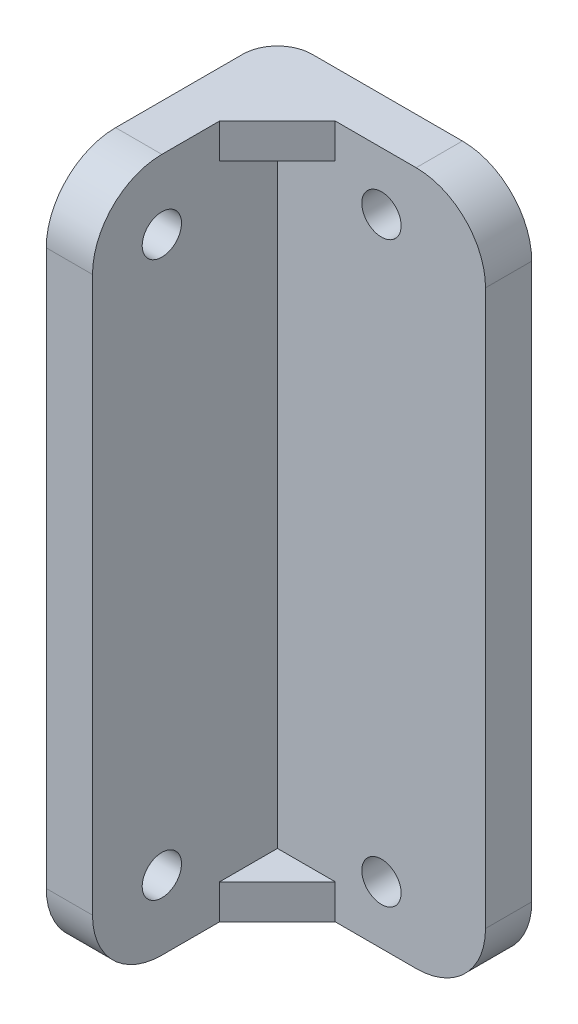
ISO-10303-21;
HEADER;
FILE_DESCRIPTION(('STEP AP214'),'2;1');
FILE_NAME('part.step','',(''),(''),'','','');
FILE_SCHEMA(('AUTOMOTIVE_DESIGN { 1 0 10303 214 1 1 1 1 }'));
ENDSEC;
DATA;
#1=APPLICATION_CONTEXT('core data for automotive mechanical design processes');
#2=APPLICATION_PROTOCOL_DEFINITION('international standard','automotive_design',2000,#1);
#3=PRODUCT_CONTEXT('',#1,'mechanical');
#4=PRODUCT('Part','Part','',(#3));
#5=PRODUCT_RELATED_PRODUCT_CATEGORY('part','',(#4));
#6=PRODUCT_DEFINITION_FORMATION('','',#4);
#7=PRODUCT_DEFINITION_CONTEXT('part definition',#1,'design');
#8=PRODUCT_DEFINITION('design','',#6,#7);
#9=PRODUCT_DEFINITION_SHAPE('','',#8);
#10=(LENGTH_UNIT() NAMED_UNIT(*) SI_UNIT(.MILLI.,.METRE.));
#11=(NAMED_UNIT(*) PLANE_ANGLE_UNIT() SI_UNIT($,.RADIAN.));
#12=(NAMED_UNIT(*) SI_UNIT($,.STERADIAN.) SOLID_ANGLE_UNIT());
#13=UNCERTAINTY_MEASURE_WITH_UNIT(LENGTH_MEASURE(1.E-05),#10,'distance_accuracy_value','');
#14=(GEOMETRIC_REPRESENTATION_CONTEXT(3) GLOBAL_UNCERTAINTY_ASSIGNED_CONTEXT((#13)) GLOBAL_UNIT_ASSIGNED_CONTEXT((#10,
#11,#12)) REPRESENTATION_CONTEXT('',''));
#15=CARTESIAN_POINT('',(0.,0.,0.));
#16=DIRECTION('',(0.,0.,1.));
#17=DIRECTION('',(1.,0.,0.));
#18=AXIS2_PLACEMENT_3D('',#15,#16,#17);
#19=CARTESIAN_POINT('',(0.,0.,4.));
#20=DIRECTION('',(0.,0.,1.));
#21=DIRECTION('',(1.,0.,0.));
#22=AXIS2_PLACEMENT_3D('',#19,#20,#21);
#23=PLANE('',#22);
#24=CARTESIAN_POINT('',(0.,0.,4.));
#25=DIRECTION('',(0.,0.,1.));
#26=DIRECTION('',(1.,0.,0.));
#27=AXIS2_PLACEMENT_3D('',#24,#25,#26);
#28=CIRCLE('',#27,1.7);
#29=CARTESIAN_POINT('',(1.7,0.,4.));
#30=VERTEX_POINT('',#29);
#31=EDGE_CURVE('E185',#30,#30,#28,.T.);
#32=ORIENTED_EDGE('',*,*,#31,.F.);
#33=EDGE_LOOP('',(#32));
#34=FACE_BOUND('',#33,.T.);
#35=CARTESIAN_POINT('',(0.,50.,4.));
#36=DIRECTION('',(0.,0.,1.));
#37=DIRECTION('',(1.,0.,0.));
#38=AXIS2_PLACEMENT_3D('',#35,#36,#37);
#39=CIRCLE('',#38,1.7);
#40=CARTESIAN_POINT('',(1.7,50.,4.));
#41=VERTEX_POINT('',#40);
#42=EDGE_CURVE('E177',#41,#41,#39,.T.);
#43=ORIENTED_EDGE('',*,*,#42,.F.);
#44=EDGE_LOOP('',(#43));
#45=FACE_BOUND('',#44,.T.);
#46=DIRECTION('',(-1.,0.,0.));
#47=VECTOR('',#46,1.);
#48=CARTESIAN_POINT('',(-8.99999999999998,-2.,4.));
#49=LINE('',#48,#47);
#50=CARTESIAN_POINT('',(-3.99999999999998,-2.,4.));
#51=VERTEX_POINT('',#50);
#52=CARTESIAN_POINT('',(-8.99999999999998,-2.,4.));
#53=VERTEX_POINT('',#52);
#54=EDGE_CURVE('E149',#51,#53,#49,.T.);
#55=ORIENTED_EDGE('',*,*,#54,.F.);
#56=DIRECTION('',(0.,-1.,0.));
#57=VECTOR('',#56,1.);
#58=CARTESIAN_POINT('',(-3.99999999999998,-2.,4.));
#59=LINE('',#58,#57);
#60=CARTESIAN_POINT('',(-3.99999999999998,-5.,4.));
#61=VERTEX_POINT('',#60);
#62=EDGE_CURVE('E356',#51,#61,#59,.T.);
#63=ORIENTED_EDGE('',*,*,#62,.T.);
#64=DIRECTION('',(-1.,0.,0.));
#65=VECTOR('',#64,1.);
#66=CARTESIAN_POINT('',(0.,-4.99999999999999,4.));
#67=LINE('',#66,#65);
#68=CARTESIAN_POINT('',(3.,-4.99999999999999,4.));
#69=VERTEX_POINT('',#68);
#70=EDGE_CURVE('E176',#69,#61,#67,.T.);
#71=ORIENTED_EDGE('',*,*,#70,.F.);
#72=CARTESIAN_POINT('',(3.,1.00000000000001,4.));
#73=DIRECTION('',(0.,0.,1.));
#74=DIRECTION('',(1.,0.,0.));
#75=AXIS2_PLACEMENT_3D('',#72,#73,#74);
#76=CIRCLE('',#75,6.);
#77=CARTESIAN_POINT('',(9.,1.00000000000001,4.));
#78=VERTEX_POINT('',#77);
#79=EDGE_CURVE('E234',#69,#78,#76,.T.);
#80=ORIENTED_EDGE('',*,*,#79,.T.);
#81=DIRECTION('',(0.,1.,0.));
#82=VECTOR('',#81,1.);
#83=CARTESIAN_POINT('',(9.,0.,4.));
#84=LINE('',#83,#82);
#85=CARTESIAN_POINT('',(9.,49.,4.));
#86=VERTEX_POINT('',#85);
#87=EDGE_CURVE('E182',#78,#86,#84,.T.);
#88=ORIENTED_EDGE('',*,*,#87,.T.);
#89=CARTESIAN_POINT('',(3.,49.,4.));
#90=DIRECTION('',(0.,0.,1.));
#91=DIRECTION('',(1.,0.,0.));
#92=AXIS2_PLACEMENT_3D('',#89,#90,#91);
#93=CIRCLE('',#92,6.);
#94=CARTESIAN_POINT('',(3.,55.,4.));
#95=VERTEX_POINT('',#94);
#96=EDGE_CURVE('E231',#86,#95,#93,.T.);
#97=ORIENTED_EDGE('',*,*,#96,.T.);
#98=DIRECTION('',(-1.,0.,0.));
#99=VECTOR('',#98,1.);
#100=CARTESIAN_POINT('',(0.,55.,4.));
#101=LINE('',#100,#99);
#102=CARTESIAN_POINT('',(-4.,55.,4.));
#103=VERTEX_POINT('',#102);
#104=EDGE_CURVE('E192',#95,#103,#101,.T.);
#105=ORIENTED_EDGE('',*,*,#104,.T.);
#106=DIRECTION('',(0.,1.,0.));
#107=VECTOR('',#106,1.);
#108=CARTESIAN_POINT('',(-4.,52.,4.));
#109=LINE('',#108,#107);
#110=CARTESIAN_POINT('',(-4.,52.,4.));
#111=VERTEX_POINT('',#110);
#112=EDGE_CURVE('E361',#111,#103,#109,.T.);
#113=ORIENTED_EDGE('',*,*,#112,.F.);
#114=DIRECTION('',(-1.,0.,0.));
#115=VECTOR('',#114,1.);
#116=CARTESIAN_POINT('',(-9.,52.,4.));
#117=LINE('',#116,#115);
#118=CARTESIAN_POINT('',(-9.,52.,4.));
#119=VERTEX_POINT('',#118);
#120=EDGE_CURVE('E174',#111,#119,#117,.T.);
#121=ORIENTED_EDGE('',*,*,#120,.T.);
#122=DIRECTION('',(0.,1.,0.));
#123=VECTOR('',#122,1.);
#124=CARTESIAN_POINT('',(-9.,0.,4.));
#125=LINE('',#124,#123);
#126=EDGE_CURVE('E165',#53,#119,#125,.T.);
#127=ORIENTED_EDGE('',*,*,#126,.F.);
#128=EDGE_LOOP('',(#55,#63,#71,#80,#88,#97,#105,#113,#121,#127));
#129=FACE_BOUND('',#128,.T.);
#130=ADVANCED_FACE('F41',(#34,#45,#129),#23,.T.);
#131=CARTESIAN_POINT('',(-9.,1.,14.));
#132=DIRECTION('',(1.,0.,0.));
#133=DIRECTION('',(0.,1.,0.));
#134=AXIS2_PLACEMENT_3D('',#131,#132,#133);
#135=PLANE('',#134);
#136=CARTESIAN_POINT('',(-9.,49.,14.));
#137=DIRECTION('',(-1.,0.,0.));
#138=DIRECTION('',(0.,-1.,0.));
#139=AXIS2_PLACEMENT_3D('',#136,#137,#138);
#140=CIRCLE('',#139,1.7);
#141=CARTESIAN_POINT('',(-9.,47.3,14.));
#142=VERTEX_POINT('',#141);
#143=EDGE_CURVE('E273',#142,#142,#140,.T.);
#144=ORIENTED_EDGE('',*,*,#143,.T.);
#145=EDGE_LOOP('',(#144));
#146=FACE_BOUND('',#145,.T.);
#147=CARTESIAN_POINT('',(-9.,1.,14.));
#148=DIRECTION('',(-1.,0.,0.));
#149=DIRECTION('',(0.,-1.,0.));
#150=AXIS2_PLACEMENT_3D('',#147,#148,#149);
#151=CIRCLE('',#150,1.7);
#152=CARTESIAN_POINT('',(-9.,-0.699999999999998,14.));
#153=VERTEX_POINT('',#152);
#154=EDGE_CURVE('E364',#153,#153,#151,.T.);
#155=ORIENTED_EDGE('',*,*,#154,.T.);
#156=EDGE_LOOP('',(#155));
#157=FACE_BOUND('',#156,.T.);
#158=DIRECTION('',(0.,0.,1.));
#159=VECTOR('',#158,1.);
#160=CARTESIAN_POINT('',(-9.,-5.,0.));
#161=LINE('',#160,#159);
#162=CARTESIAN_POINT('',(-9.,-5.,9.));
#163=VERTEX_POINT('',#162);
#164=CARTESIAN_POINT('',(-9.,-5.,14.));
#165=VERTEX_POINT('',#164);
#166=EDGE_CURVE('E284',#163,#165,#161,.T.);
#167=ORIENTED_EDGE('',*,*,#166,.F.);
#168=DIRECTION('',(0.,-1.,0.));
#169=VECTOR('',#168,1.);
#170=CARTESIAN_POINT('',(-8.99999999999998,-2.,9.));
#171=LINE('',#170,#169);
#172=CARTESIAN_POINT('',(-8.99999999999998,-2.,9.));
#173=VERTEX_POINT('',#172);
#174=EDGE_CURVE('E167',#173,#163,#171,.T.);
#175=ORIENTED_EDGE('',*,*,#174,.F.);
#176=DIRECTION('',(0.,0.,1.));
#177=VECTOR('',#176,1.);
#178=CARTESIAN_POINT('',(-8.99999999999998,-2.,4.));
#179=LINE('',#178,#177);
#180=EDGE_CURVE('E152',#53,#173,#179,.T.);
#181=ORIENTED_EDGE('',*,*,#180,.F.);
#182=ORIENTED_EDGE('',*,*,#126,.T.);
#183=DIRECTION('',(0.,0.,1.));
#184=VECTOR('',#183,1.);
#185=CARTESIAN_POINT('',(-9.,52.,4.));
#186=LINE('',#185,#184);
#187=CARTESIAN_POINT('',(-9.,52.,9.));
#188=VERTEX_POINT('',#187);
#189=EDGE_CURVE('E350',#119,#188,#186,.T.);
#190=ORIENTED_EDGE('',*,*,#189,.T.);
#191=DIRECTION('',(0.,1.,0.));
#192=VECTOR('',#191,1.);
#193=CARTESIAN_POINT('',(-9.,52.,9.));
#194=LINE('',#193,#192);
#195=CARTESIAN_POINT('',(-9.,55.,9.));
#196=VERTEX_POINT('',#195);
#197=EDGE_CURVE('E365',#188,#196,#194,.T.);
#198=ORIENTED_EDGE('',*,*,#197,.T.);
#199=DIRECTION('',(0.,0.,-1.));
#200=VECTOR('',#199,1.);
#201=CARTESIAN_POINT('',(-9.,55.,0.));
#202=LINE('',#201,#200);
#203=CARTESIAN_POINT('',(-9.,55.,14.));
#204=VERTEX_POINT('',#203);
#205=EDGE_CURVE('E263',#204,#196,#202,.T.);
#206=ORIENTED_EDGE('',*,*,#205,.F.);
#207=CARTESIAN_POINT('',(-9.,49.,14.));
#208=DIRECTION('',(-1.,0.,0.));
#209=DIRECTION('',(0.,-1.,0.));
#210=AXIS2_PLACEMENT_3D('',#207,#208,#209);
#211=CIRCLE('',#210,6.);
#212=CARTESIAN_POINT('',(-9.,49.,20.));
#213=VERTEX_POINT('',#212);
#214=EDGE_CURVE('E270',#213,#204,#211,.T.);
#215=ORIENTED_EDGE('',*,*,#214,.F.);
#216=DIRECTION('',(0.,1.,0.));
#217=VECTOR('',#216,1.);
#218=CARTESIAN_POINT('',(-9.,49.,20.));
#219=LINE('',#218,#217);
#220=CARTESIAN_POINT('',(-9.,1.00000000000005,20.));
#221=VERTEX_POINT('',#220);
#222=EDGE_CURVE('E291',#221,#213,#219,.T.);
#223=ORIENTED_EDGE('',*,*,#222,.F.);
#224=CARTESIAN_POINT('',(-9.,1.,14.));
#225=DIRECTION('',(-1.,0.,0.));
#226=DIRECTION('',(0.,1.,0.));
#227=AXIS2_PLACEMENT_3D('',#224,#225,#226);
#228=CIRCLE('',#227,6.);
#229=EDGE_CURVE('E287',#165,#221,#228,.T.);
#230=ORIENTED_EDGE('',*,*,#229,.F.);
#231=EDGE_LOOP('',(#167,#175,#181,#182,#190,#198,#206,#215,#223,#230));
#232=FACE_BOUND('',#231,.T.);
#233=ADVANCED_FACE('F163',(#146,#157,#232),#135,.T.);
#234=CARTESIAN_POINT('',(0.,-4.99999999999999,4.));
#235=DIRECTION('',(0.,-1.,0.));
#236=DIRECTION('',(1.,0.,0.));
#237=AXIS2_PLACEMENT_3D('',#234,#235,#236);
#238=PLANE('',#237);
#239=DIRECTION('',(0.,0.,1.));
#240=VECTOR('',#239,1.);
#241=CARTESIAN_POINT('',(-13.,-5.,0.));
#242=LINE('',#241,#240);
#243=CARTESIAN_POINT('',(-13.,-5.,3.));
#244=VERTEX_POINT('',#243);
#245=CARTESIAN_POINT('',(-13.,-5.,14.));
#246=VERTEX_POINT('',#245);
#247=EDGE_CURVE('E252',#244,#246,#242,.T.);
#248=ORIENTED_EDGE('',*,*,#247,.F.);
#249=CARTESIAN_POINT('',(-10.,-5.,3.));
#250=DIRECTION('',(0.,-1.,0.));
#251=DIRECTION('',(1.,0.,0.));
#252=AXIS2_PLACEMENT_3D('',#249,#250,#251);
#253=CIRCLE('',#252,3.);
#254=CARTESIAN_POINT('',(-10.,-5.,0.));
#255=VERTEX_POINT('',#254);
#256=EDGE_CURVE('E64',#244,#255,#253,.T.);
#257=ORIENTED_EDGE('',*,*,#256,.T.);
#258=DIRECTION('',(-1.,0.,0.));
#259=VECTOR('',#258,1.);
#260=CARTESIAN_POINT('',(0.,-4.99999999999999,0.));
#261=LINE('',#260,#259);
#262=CARTESIAN_POINT('',(3.,-4.99999999999999,0.));
#263=VERTEX_POINT('',#262);
#264=EDGE_CURVE('E206',#263,#255,#261,.T.);
#265=ORIENTED_EDGE('',*,*,#264,.F.);
#266=DIRECTION('',(0.,0.,-1.));
#267=VECTOR('',#266,1.);
#268=CARTESIAN_POINT('',(3.,-4.99999999999999,4.));
#269=LINE('',#268,#267);
#270=EDGE_CURVE('E228',#263,#69,#269,.F.);
#271=ORIENTED_EDGE('',*,*,#270,.T.);
#272=ORIENTED_EDGE('',*,*,#70,.T.);
#273=DIRECTION('',(0.707106781186548,0.,-0.707106781186547));
#274=VECTOR('',#273,1.);
#275=CARTESIAN_POINT('',(-3.99999999999998,-5.,4.));
#276=LINE('',#275,#274);
#277=EDGE_CURVE('E169',#163,#61,#276,.T.);
#278=ORIENTED_EDGE('',*,*,#277,.F.);
#279=ORIENTED_EDGE('',*,*,#166,.T.);
#280=DIRECTION('',(1.,0.,0.));
#281=VECTOR('',#280,1.);
#282=CARTESIAN_POINT('',(-13.,-5.,14.));
#283=LINE('',#282,#281);
#284=EDGE_CURVE('E202',#246,#165,#283,.T.);
#285=ORIENTED_EDGE('',*,*,#284,.F.);
#286=EDGE_LOOP('',(#248,#257,#265,#271,#272,#278,#279,#285));
#287=FACE_BOUND('',#286,.T.);
#288=ADVANCED_FACE('F258',(#287),#238,.T.);
#289=CARTESIAN_POINT('',(9.,0.,4.));
#290=DIRECTION('',(-1.,0.,0.));
#291=DIRECTION('',(0.,0.,1.));
#292=AXIS2_PLACEMENT_3D('',#289,#290,#291);
#293=PLANE('',#292);
#294=ORIENTED_EDGE('',*,*,#87,.F.);
#295=DIRECTION('',(0.,0.,-1.));
#296=VECTOR('',#295,1.);
#297=CARTESIAN_POINT('',(9.,1.00000000000001,0.));
#298=LINE('',#297,#296);
#299=CARTESIAN_POINT('',(9.,1.00000000000001,0.));
#300=VERTEX_POINT('',#299);
#301=EDGE_CURVE('E218',#78,#300,#298,.T.);
#302=ORIENTED_EDGE('',*,*,#301,.T.);
#303=DIRECTION('',(0.,1.,0.));
#304=VECTOR('',#303,1.);
#305=CARTESIAN_POINT('',(9.,0.,0.));
#306=LINE('',#305,#304);
#307=CARTESIAN_POINT('',(9.,49.,0.));
#308=VERTEX_POINT('',#307);
#309=EDGE_CURVE('E209',#300,#308,#306,.T.);
#310=ORIENTED_EDGE('',*,*,#309,.T.);
#311=DIRECTION('',(0.,0.,-1.));
#312=VECTOR('',#311,1.);
#313=CARTESIAN_POINT('',(9.,49.,4.));
#314=LINE('',#313,#312);
#315=EDGE_CURVE('E196',#308,#86,#314,.F.);
#316=ORIENTED_EDGE('',*,*,#315,.T.);
#317=EDGE_LOOP('',(#294,#302,#310,#316));
#318=FACE_BOUND('',#317,.T.);
#319=ADVANCED_FACE('F323',(#318),#293,.F.);
#320=CARTESIAN_POINT('',(0.,50.,4.));
#321=DIRECTION('',(0.,0.,-1.));
#322=DIRECTION('',(-1.,0.,0.));
#323=AXIS2_PLACEMENT_3D('',#320,#321,#322);
#324=CYLINDRICAL_SURFACE('',#323,1.7);
#325=ORIENTED_EDGE('',*,*,#42,.T.);
#326=EDGE_LOOP('',(#325));
#327=FACE_BOUND('',#326,.T.);
#328=CARTESIAN_POINT('',(0.,50.,0.));
#329=DIRECTION('',(0.,0.,1.));
#330=DIRECTION('',(1.,0.,0.));
#331=AXIS2_PLACEMENT_3D('',#328,#329,#330);
#332=CIRCLE('',#331,1.7);
#333=CARTESIAN_POINT('',(1.7,50.,0.));
#334=VERTEX_POINT('',#333);
#335=EDGE_CURVE('E201',#334,#334,#332,.T.);
#336=ORIENTED_EDGE('',*,*,#335,.F.);
#337=EDGE_LOOP('',(#336));
#338=FACE_BOUND('',#337,.T.);
#339=ADVANCED_FACE('F320',(#327,#338),#324,.F.);
#340=CARTESIAN_POINT('',(0.,0.,4.));
#341=DIRECTION('',(0.,0.,-1.));
#342=DIRECTION('',(-1.,0.,0.));
#343=AXIS2_PLACEMENT_3D('',#340,#341,#342);
#344=CYLINDRICAL_SURFACE('',#343,1.7);
#345=ORIENTED_EDGE('',*,*,#31,.T.);
#346=EDGE_LOOP('',(#345));
#347=FACE_BOUND('',#346,.T.);
#348=CARTESIAN_POINT('',(0.,0.,0.));
#349=DIRECTION('',(0.,0.,1.));
#350=DIRECTION('',(1.,0.,0.));
#351=AXIS2_PLACEMENT_3D('',#348,#349,#350);
#352=CIRCLE('',#351,1.7);
#353=CARTESIAN_POINT('',(1.7,0.,0.));
#354=VERTEX_POINT('',#353);
#355=EDGE_CURVE('E197',#354,#354,#352,.T.);
#356=ORIENTED_EDGE('',*,*,#355,.F.);
#357=EDGE_LOOP('',(#356));
#358=FACE_BOUND('',#357,.T.);
#359=ADVANCED_FACE('F312',(#347,#358),#344,.F.);
#360=CARTESIAN_POINT('',(0.,55.,4.));
#361=DIRECTION('',(0.,-1.,0.));
#362=DIRECTION('',(1.,0.,0.));
#363=AXIS2_PLACEMENT_3D('',#360,#361,#362);
#364=PLANE('',#363);
#365=DIRECTION('',(-1.,0.,0.));
#366=VECTOR('',#365,1.);
#367=CARTESIAN_POINT('',(0.,55.,0.));
#368=LINE('',#367,#366);
#369=CARTESIAN_POINT('',(3.,55.,0.));
#370=VERTEX_POINT('',#369);
#371=CARTESIAN_POINT('',(-10.,55.,0.));
#372=VERTEX_POINT('',#371);
#373=EDGE_CURVE('E213',#370,#372,#368,.T.);
#374=ORIENTED_EDGE('',*,*,#373,.T.);
#375=CARTESIAN_POINT('',(-10.,55.,3.));
#376=DIRECTION('',(0.,-1.,0.));
#377=DIRECTION('',(1.,0.,0.));
#378=AXIS2_PLACEMENT_3D('',#375,#376,#377);
#379=CIRCLE('',#378,3.);
#380=CARTESIAN_POINT('',(-13.,55.,3.));
#381=VERTEX_POINT('',#380);
#382=EDGE_CURVE('E11',#372,#381,#379,.F.);
#383=ORIENTED_EDGE('',*,*,#382,.T.);
#384=DIRECTION('',(0.,0.,-1.));
#385=VECTOR('',#384,1.);
#386=CARTESIAN_POINT('',(-13.,55.,0.));
#387=LINE('',#386,#385);
#388=CARTESIAN_POINT('',(-13.,55.,14.));
#389=VERTEX_POINT('',#388);
#390=EDGE_CURVE('E255',#389,#381,#387,.T.);
#391=ORIENTED_EDGE('',*,*,#390,.F.);
#392=DIRECTION('',(1.,0.,0.));
#393=VECTOR('',#392,1.);
#394=CARTESIAN_POINT('',(-13.,55.,14.));
#395=LINE('',#394,#393);
#396=EDGE_CURVE('E283',#389,#204,#395,.T.);
#397=ORIENTED_EDGE('',*,*,#396,.T.);
#398=ORIENTED_EDGE('',*,*,#205,.T.);
#399=DIRECTION('',(0.707106781186548,0.,-0.707106781186547));
#400=VECTOR('',#399,1.);
#401=CARTESIAN_POINT('',(-4.,55.,4.));
#402=LINE('',#401,#400);
#403=EDGE_CURVE('E345',#196,#103,#402,.T.);
#404=ORIENTED_EDGE('',*,*,#403,.T.);
#405=ORIENTED_EDGE('',*,*,#104,.F.);
#406=DIRECTION('',(0.,0.,-1.));
#407=VECTOR('',#406,1.);
#408=CARTESIAN_POINT('',(3.,55.,4.));
#409=LINE('',#408,#407);
#410=EDGE_CURVE('E237',#95,#370,#409,.T.);
#411=ORIENTED_EDGE('',*,*,#410,.T.);
#412=EDGE_LOOP('',(#374,#383,#391,#397,#398,#404,#405,#411));
#413=FACE_BOUND('',#412,.T.);
#414=ADVANCED_FACE('F329',(#413),#364,.F.);
#415=CARTESIAN_POINT('',(0.,0.,0.));
#416=DIRECTION('',(0.,0.,1.));
#417=DIRECTION('',(1.,0.,0.));
#418=AXIS2_PLACEMENT_3D('',#415,#416,#417);
#419=PLANE('',#418);
#420=ORIENTED_EDGE('',*,*,#355,.T.);
#421=EDGE_LOOP('',(#420));
#422=FACE_BOUND('',#421,.T.);
#423=ORIENTED_EDGE('',*,*,#335,.T.);
#424=EDGE_LOOP('',(#423));
#425=FACE_BOUND('',#424,.T.);
#426=ORIENTED_EDGE('',*,*,#264,.T.);
#427=DIRECTION('',(0.,-1.,0.));
#428=VECTOR('',#427,1.);
#429=CARTESIAN_POINT('',(-10.,0.,0.));
#430=LINE('',#429,#428);
#431=EDGE_CURVE('E50',#255,#372,#430,.F.);
#432=ORIENTED_EDGE('',*,*,#431,.T.);
#433=ORIENTED_EDGE('',*,*,#373,.F.);
#434=CARTESIAN_POINT('',(3.,49.,0.));
#435=DIRECTION('',(0.,0.,1.));
#436=DIRECTION('',(1.,0.,0.));
#437=AXIS2_PLACEMENT_3D('',#434,#435,#436);
#438=CIRCLE('',#437,6.);
#439=EDGE_CURVE('E222',#370,#308,#438,.F.);
#440=ORIENTED_EDGE('',*,*,#439,.T.);
#441=ORIENTED_EDGE('',*,*,#309,.F.);
#442=CARTESIAN_POINT('',(3.,1.00000000000001,0.));
#443=DIRECTION('',(0.,0.,1.));
#444=DIRECTION('',(1.,0.,0.));
#445=AXIS2_PLACEMENT_3D('',#442,#443,#444);
#446=CIRCLE('',#445,6.);
#447=EDGE_CURVE('E225',#300,#263,#446,.F.);
#448=ORIENTED_EDGE('',*,*,#447,.T.);
#449=EDGE_LOOP('',(#426,#432,#433,#440,#441,#448));
#450=FACE_BOUND('',#449,.T.);
#451=ADVANCED_FACE('F327',(#422,#425,#450),#419,.F.);
#452=CARTESIAN_POINT('',(-13.,1.,14.));
#453=DIRECTION('',(1.,0.,0.));
#454=DIRECTION('',(0.,1.,0.));
#455=AXIS2_PLACEMENT_3D('',#452,#453,#454);
#456=PLANE('',#455);
#457=ORIENTED_EDGE('',*,*,#390,.T.);
#458=DIRECTION('',(0.,-1.,0.));
#459=VECTOR('',#458,1.);
#460=CARTESIAN_POINT('',(-13.,1.,3.));
#461=LINE('',#460,#459);
#462=EDGE_CURVE('E241',#381,#244,#461,.T.);
#463=ORIENTED_EDGE('',*,*,#462,.T.);
#464=ORIENTED_EDGE('',*,*,#247,.T.);
#465=CARTESIAN_POINT('',(-13.,1.,14.));
#466=DIRECTION('',(-1.,0.,0.));
#467=DIRECTION('',(0.,1.,0.));
#468=AXIS2_PLACEMENT_3D('',#465,#466,#467);
#469=CIRCLE('',#468,6.);
#470=CARTESIAN_POINT('',(-13.,1.00000000000005,20.));
#471=VERTEX_POINT('',#470);
#472=EDGE_CURVE('E262',#246,#471,#469,.T.);
#473=ORIENTED_EDGE('',*,*,#472,.T.);
#474=DIRECTION('',(0.,1.,0.));
#475=VECTOR('',#474,1.);
#476=CARTESIAN_POINT('',(-13.,49.,20.));
#477=LINE('',#476,#475);
#478=CARTESIAN_POINT('',(-13.,49.,20.));
#479=VERTEX_POINT('',#478);
#480=EDGE_CURVE('E267',#471,#479,#477,.T.);
#481=ORIENTED_EDGE('',*,*,#480,.T.);
#482=CARTESIAN_POINT('',(-13.,49.,14.));
#483=DIRECTION('',(-1.,0.,0.));
#484=DIRECTION('',(0.,-1.,0.));
#485=AXIS2_PLACEMENT_3D('',#482,#483,#484);
#486=CIRCLE('',#485,6.);
#487=EDGE_CURVE('E278',#479,#389,#486,.T.);
#488=ORIENTED_EDGE('',*,*,#487,.T.);
#489=EDGE_LOOP('',(#457,#463,#464,#473,#481,#488));
#490=FACE_BOUND('',#489,.T.);
#491=CARTESIAN_POINT('',(-13.,49.,14.));
#492=DIRECTION('',(-1.,0.,0.));
#493=DIRECTION('',(0.,-1.,0.));
#494=AXIS2_PLACEMENT_3D('',#491,#492,#493);
#495=CIRCLE('',#494,1.7);
#496=CARTESIAN_POINT('',(-13.,47.3,14.));
#497=VERTEX_POINT('',#496);
#498=EDGE_CURVE('E288',#497,#497,#495,.T.);
#499=ORIENTED_EDGE('',*,*,#498,.F.);
#500=EDGE_LOOP('',(#499));
#501=FACE_BOUND('',#500,.T.);
#502=CARTESIAN_POINT('',(-13.,1.,14.));
#503=DIRECTION('',(-1.,0.,0.));
#504=DIRECTION('',(0.,-1.,0.));
#505=AXIS2_PLACEMENT_3D('',#502,#503,#504);
#506=CIRCLE('',#505,1.7);
#507=CARTESIAN_POINT('',(-13.,-0.699999999999998,14.));
#508=VERTEX_POINT('',#507);
#509=EDGE_CURVE('E368',#508,#508,#506,.T.);
#510=ORIENTED_EDGE('',*,*,#509,.F.);
#511=EDGE_LOOP('',(#510));
#512=FACE_BOUND('',#511,.T.);
#513=ADVANCED_FACE('F250',(#490,#501,#512),#456,.F.);
#514=CARTESIAN_POINT('',(-13.,1.,14.));
#515=DIRECTION('',(1.,0.,0.));
#516=DIRECTION('',(0.,1.,0.));
#517=AXIS2_PLACEMENT_3D('',#514,#515,#516);
#518=CYLINDRICAL_SURFACE('',#517,6.);
#519=ORIENTED_EDGE('',*,*,#229,.T.);
#520=DIRECTION('',(1.,0.,0.));
#521=VECTOR('',#520,1.);
#522=CARTESIAN_POINT('',(-13.,1.00000000000005,20.));
#523=LINE('',#522,#521);
#524=EDGE_CURVE('E303',#471,#221,#523,.T.);
#525=ORIENTED_EDGE('',*,*,#524,.F.);
#526=ORIENTED_EDGE('',*,*,#472,.F.);
#527=ORIENTED_EDGE('',*,*,#284,.T.);
#528=EDGE_LOOP('',(#519,#525,#526,#527));
#529=FACE_BOUND('',#528,.T.);
#530=ADVANCED_FACE('F403',(#529),#518,.T.);
#531=CARTESIAN_POINT('',(-13.,49.,20.));
#532=DIRECTION('',(0.,0.,-1.));
#533=DIRECTION('',(0.,1.,0.));
#534=AXIS2_PLACEMENT_3D('',#531,#532,#533);
#535=PLANE('',#534);
#536=ORIENTED_EDGE('',*,*,#222,.T.);
#537=DIRECTION('',(1.,0.,0.));
#538=VECTOR('',#537,1.);
#539=CARTESIAN_POINT('',(-13.,49.,20.));
#540=LINE('',#539,#538);
#541=EDGE_CURVE('E299',#479,#213,#540,.T.);
#542=ORIENTED_EDGE('',*,*,#541,.F.);
#543=ORIENTED_EDGE('',*,*,#480,.F.);
#544=ORIENTED_EDGE('',*,*,#524,.T.);
#545=EDGE_LOOP('',(#536,#542,#543,#544));
#546=FACE_BOUND('',#545,.T.);
#547=ADVANCED_FACE('F396',(#546),#535,.F.);
#548=CARTESIAN_POINT('',(-13.,49.,14.));
#549=DIRECTION('',(1.,0.,0.));
#550=DIRECTION('',(0.,1.,0.));
#551=AXIS2_PLACEMENT_3D('',#548,#549,#550);
#552=CYLINDRICAL_SURFACE('',#551,6.);
#553=ORIENTED_EDGE('',*,*,#214,.T.);
#554=ORIENTED_EDGE('',*,*,#396,.F.);
#555=ORIENTED_EDGE('',*,*,#487,.F.);
#556=ORIENTED_EDGE('',*,*,#541,.T.);
#557=EDGE_LOOP('',(#553,#554,#555,#556));
#558=FACE_BOUND('',#557,.T.);
#559=ADVANCED_FACE('F387',(#558),#552,.T.);
#560=CARTESIAN_POINT('',(-13.,49.,14.));
#561=DIRECTION('',(1.,0.,0.));
#562=DIRECTION('',(0.,1.,0.));
#563=AXIS2_PLACEMENT_3D('',#560,#561,#562);
#564=CYLINDRICAL_SURFACE('',#563,1.7);
#565=ORIENTED_EDGE('',*,*,#498,.T.);
#566=EDGE_LOOP('',(#565));
#567=FACE_BOUND('',#566,.T.);
#568=ORIENTED_EDGE('',*,*,#143,.F.);
#569=EDGE_LOOP('',(#568));
#570=FACE_BOUND('',#569,.T.);
#571=ADVANCED_FACE('F384',(#567,#570),#564,.F.);
#572=CARTESIAN_POINT('',(-13.,1.,14.));
#573=DIRECTION('',(1.,0.,0.));
#574=DIRECTION('',(0.,1.,0.));
#575=AXIS2_PLACEMENT_3D('',#572,#573,#574);
#576=CYLINDRICAL_SURFACE('',#575,1.7);
#577=ORIENTED_EDGE('',*,*,#509,.T.);
#578=EDGE_LOOP('',(#577));
#579=FACE_BOUND('',#578,.T.);
#580=ORIENTED_EDGE('',*,*,#154,.F.);
#581=EDGE_LOOP('',(#580));
#582=FACE_BOUND('',#581,.T.);
#583=ADVANCED_FACE('F386',(#579,#582),#576,.F.);
#584=CARTESIAN_POINT('',(3.,1.00000000000001,4.));
#585=DIRECTION('',(0.,0.,1.));
#586=DIRECTION('',(1.,0.,0.));
#587=AXIS2_PLACEMENT_3D('',#584,#585,#586);
#588=CYLINDRICAL_SURFACE('',#587,6.);
#589=ORIENTED_EDGE('',*,*,#79,.F.);
#590=ORIENTED_EDGE('',*,*,#270,.F.);
#591=ORIENTED_EDGE('',*,*,#447,.F.);
#592=ORIENTED_EDGE('',*,*,#301,.F.);
#593=EDGE_LOOP('',(#589,#590,#591,#592));
#594=FACE_BOUND('',#593,.T.);
#595=ADVANCED_FACE('F393',(#594),#588,.T.);
#596=CARTESIAN_POINT('',(3.,49.,4.));
#597=DIRECTION('',(0.,0.,-1.));
#598=DIRECTION('',(-1.,0.,0.));
#599=AXIS2_PLACEMENT_3D('',#596,#597,#598);
#600=CYLINDRICAL_SURFACE('',#599,6.);
#601=ORIENTED_EDGE('',*,*,#96,.F.);
#602=ORIENTED_EDGE('',*,*,#315,.F.);
#603=ORIENTED_EDGE('',*,*,#439,.F.);
#604=ORIENTED_EDGE('',*,*,#410,.F.);
#605=EDGE_LOOP('',(#601,#602,#603,#604));
#606=FACE_BOUND('',#605,.T.);
#607=ADVANCED_FACE('F343',(#606),#600,.T.);
#608=CARTESIAN_POINT('',(-4.,52.,4.));
#609=DIRECTION('',(0.707106781186547,0.,0.707106781186548));
#610=DIRECTION('',(0.707106781186548,0.,-0.707106781186547));
#611=AXIS2_PLACEMENT_3D('',#608,#609,#610);
#612=PLANE('',#611);
#613=ORIENTED_EDGE('',*,*,#403,.F.);
#614=ORIENTED_EDGE('',*,*,#197,.F.);
#615=DIRECTION('',(0.707106781186548,0.,-0.707106781186547));
#616=VECTOR('',#615,1.);
#617=CARTESIAN_POINT('',(-4.,52.,4.));
#618=LINE('',#617,#616);
#619=EDGE_CURVE('E354',#188,#111,#618,.T.);
#620=ORIENTED_EDGE('',*,*,#619,.T.);
#621=ORIENTED_EDGE('',*,*,#112,.T.);
#622=EDGE_LOOP('',(#613,#614,#620,#621));
#623=FACE_BOUND('',#622,.T.);
#624=ADVANCED_FACE('F423',(#623),#612,.T.);
#625=CARTESIAN_POINT('',(0.,52.,0.));
#626=DIRECTION('',(0.,1.,0.));
#627=DIRECTION('',(0.,0.,1.));
#628=AXIS2_PLACEMENT_3D('',#625,#626,#627);
#629=PLANE('',#628);
#630=ORIENTED_EDGE('',*,*,#189,.F.);
#631=ORIENTED_EDGE('',*,*,#120,.F.);
#632=ORIENTED_EDGE('',*,*,#619,.F.);
#633=EDGE_LOOP('',(#630,#631,#632));
#634=FACE_BOUND('',#633,.T.);
#635=ADVANCED_FACE('F427',(#634),#629,.F.);
#636=CARTESIAN_POINT('',(-3.99999999999998,-2.,4.));
#637=DIRECTION('',(-0.707106781186547,0.,-0.707106781186548));
#638=DIRECTION('',(-0.707106781186548,0.,0.707106781186547));
#639=AXIS2_PLACEMENT_3D('',#636,#637,#638);
#640=PLANE('',#639);
#641=ORIENTED_EDGE('',*,*,#277,.T.);
#642=ORIENTED_EDGE('',*,*,#62,.F.);
#643=DIRECTION('',(0.707106781186548,0.,-0.707106781186547));
#644=VECTOR('',#643,1.);
#645=CARTESIAN_POINT('',(-3.99999999999998,-2.,4.));
#646=LINE('',#645,#644);
#647=EDGE_CURVE('E154',#173,#51,#646,.T.);
#648=ORIENTED_EDGE('',*,*,#647,.F.);
#649=ORIENTED_EDGE('',*,*,#174,.T.);
#650=EDGE_LOOP('',(#641,#642,#648,#649));
#651=FACE_BOUND('',#650,.T.);
#652=ADVANCED_FACE('F431',(#651),#640,.F.);
#653=CARTESIAN_POINT('',(0.,-2.,0.));
#654=DIRECTION('',(0.,-1.,0.));
#655=DIRECTION('',(0.,0.,1.));
#656=AXIS2_PLACEMENT_3D('',#653,#654,#655);
#657=PLANE('',#656);
#658=ORIENTED_EDGE('',*,*,#180,.T.);
#659=ORIENTED_EDGE('',*,*,#647,.T.);
#660=ORIENTED_EDGE('',*,*,#54,.T.);
#661=EDGE_LOOP('',(#658,#659,#660));
#662=FACE_BOUND('',#661,.T.);
#663=ADVANCED_FACE('F151',(#662),#657,.F.);
#664=CARTESIAN_POINT('',(-10.,1.,3.));
#665=DIRECTION('',(0.,-1.,0.));
#666=DIRECTION('',(1.,0.,0.));
#667=AXIS2_PLACEMENT_3D('',#664,#665,#666);
#668=CYLINDRICAL_SURFACE('',#667,3.);
#669=ORIENTED_EDGE('',*,*,#382,.F.);
#670=ORIENTED_EDGE('',*,*,#431,.F.);
#671=ORIENTED_EDGE('',*,*,#256,.F.);
#672=ORIENTED_EDGE('',*,*,#462,.F.);
#673=EDGE_LOOP('',(#669,#670,#671,#672));
#674=FACE_BOUND('',#673,.T.);
#675=ADVANCED_FACE('F43',(#674),#668,.T.);
#676=CLOSED_SHELL('',(#130,#233,#288,#319,#339,#359,#414,#451,#513,#530,#547,#559,#571,#583,
#595,#607,#624,#635,#652,#663,#675));
#677=MANIFOLD_SOLID_BREP('B2',#676);
#678=ADVANCED_BREP_SHAPE_REPRESENTATION('',(#18,#677),#14);
#679=SHAPE_DEFINITION_REPRESENTATION(#9,#678);
ENDSEC;
END-ISO-10303-21;
